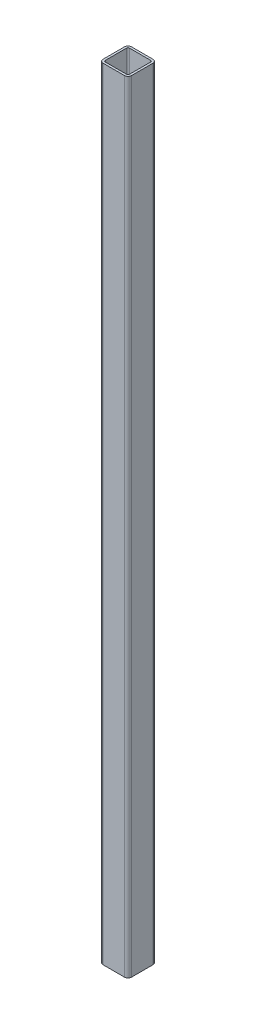
ISO-10303-21;
HEADER;
FILE_DESCRIPTION(('STEP AP214'),'2;1');
FILE_NAME('part.step','',(''),(''),'','','');
FILE_SCHEMA(('AUTOMOTIVE_DESIGN { 1 0 10303 214 1 1 1 1 }'));
ENDSEC;
DATA;
#1=APPLICATION_CONTEXT('core data for automotive mechanical design processes');
#2=APPLICATION_PROTOCOL_DEFINITION('international standard','automotive_design',2000,#1);
#3=PRODUCT_CONTEXT('',#1,'mechanical');
#4=PRODUCT('Part','Part','',(#3));
#5=PRODUCT_RELATED_PRODUCT_CATEGORY('part','',(#4));
#6=PRODUCT_DEFINITION_FORMATION('','',#4);
#7=PRODUCT_DEFINITION_CONTEXT('part definition',#1,'design');
#8=PRODUCT_DEFINITION('design','',#6,#7);
#9=PRODUCT_DEFINITION_SHAPE('','',#8);
#10=(LENGTH_UNIT() NAMED_UNIT(*) SI_UNIT(.MILLI.,.METRE.));
#11=(NAMED_UNIT(*) PLANE_ANGLE_UNIT() SI_UNIT($,.RADIAN.));
#12=(NAMED_UNIT(*) SI_UNIT($,.STERADIAN.) SOLID_ANGLE_UNIT());
#13=UNCERTAINTY_MEASURE_WITH_UNIT(LENGTH_MEASURE(1.E-05),#10,'distance_accuracy_value','');
#14=(GEOMETRIC_REPRESENTATION_CONTEXT(3) GLOBAL_UNCERTAINTY_ASSIGNED_CONTEXT((#13)) GLOBAL_UNIT_ASSIGNED_CONTEXT((#10,
#11,#12)) REPRESENTATION_CONTEXT('',''));
#15=CARTESIAN_POINT('',(0.,0.,0.));
#16=DIRECTION('',(0.,0.,1.));
#17=DIRECTION('',(1.,0.,0.));
#18=AXIS2_PLACEMENT_3D('',#15,#16,#17);
#19=CARTESIAN_POINT('',(-15.,1100.,15.));
#20=DIRECTION('',(0.,1.,0.));
#21=DIRECTION('',(0.,0.,1.));
#22=AXIS2_PLACEMENT_3D('',#19,#20,#21);
#23=PLANE('',#22);
#24=CARTESIAN_POINT('',(-15.,1100.,15.));
#25=DIRECTION('',(0.,1.,0.));
#26=DIRECTION('',(0.,0.,1.));
#27=AXIS2_PLACEMENT_3D('',#24,#25,#26);
#28=CIRCLE('',#27,5.);
#29=CARTESIAN_POINT('',(-20.,1100.,15.));
#30=VERTEX_POINT('',#29);
#31=CARTESIAN_POINT('',(-15.,1100.,20.));
#32=VERTEX_POINT('',#31);
#33=EDGE_CURVE('E261',#30,#32,#28,.T.);
#34=ORIENTED_EDGE('',*,*,#33,.T.);
#35=DIRECTION('',(1.,0.,0.));
#36=VECTOR('',#35,1.);
#37=CARTESIAN_POINT('',(-15.,1100.,20.));
#38=LINE('',#37,#36);
#39=CARTESIAN_POINT('',(15.,1100.,20.));
#40=VERTEX_POINT('',#39);
#41=EDGE_CURVE('E264',#32,#40,#38,.T.);
#42=ORIENTED_EDGE('',*,*,#41,.T.);
#43=CARTESIAN_POINT('',(15.,1100.,15.));
#44=DIRECTION('',(0.,1.,0.));
#45=DIRECTION('',(0.,0.,1.));
#46=AXIS2_PLACEMENT_3D('',#43,#44,#45);
#47=CIRCLE('',#46,5.);
#48=CARTESIAN_POINT('',(20.,1100.,15.));
#49=VERTEX_POINT('',#48);
#50=EDGE_CURVE('E267',#40,#49,#47,.T.);
#51=ORIENTED_EDGE('',*,*,#50,.T.);
#52=DIRECTION('',(0.,0.,-1.));
#53=VECTOR('',#52,1.);
#54=CARTESIAN_POINT('',(20.,1100.,-15.));
#55=LINE('',#54,#53);
#56=CARTESIAN_POINT('',(20.,1100.,-15.));
#57=VERTEX_POINT('',#56);
#58=EDGE_CURVE('E269',#49,#57,#55,.T.);
#59=ORIENTED_EDGE('',*,*,#58,.T.);
#60=CARTESIAN_POINT('',(15.,1100.,-15.));
#61=DIRECTION('',(0.,1.,0.));
#62=DIRECTION('',(0.,0.,-1.));
#63=AXIS2_PLACEMENT_3D('',#60,#61,#62);
#64=CIRCLE('',#63,5.);
#65=CARTESIAN_POINT('',(15.,1100.,-20.));
#66=VERTEX_POINT('',#65);
#67=EDGE_CURVE('E271',#57,#66,#64,.T.);
#68=ORIENTED_EDGE('',*,*,#67,.T.);
#69=DIRECTION('',(-1.,0.,0.));
#70=VECTOR('',#69,1.);
#71=CARTESIAN_POINT('',(-15.,1100.,-20.));
#72=LINE('',#71,#70);
#73=CARTESIAN_POINT('',(-15.,1100.,-20.));
#74=VERTEX_POINT('',#73);
#75=EDGE_CURVE('E273',#66,#74,#72,.T.);
#76=ORIENTED_EDGE('',*,*,#75,.T.);
#77=CARTESIAN_POINT('',(-15.,1100.,-15.));
#78=DIRECTION('',(0.,1.,0.));
#79=DIRECTION('',(0.,0.,1.));
#80=AXIS2_PLACEMENT_3D('',#77,#78,#79);
#81=CIRCLE('',#80,5.);
#82=CARTESIAN_POINT('',(-20.,1100.,-15.));
#83=VERTEX_POINT('',#82);
#84=EDGE_CURVE('E275',#74,#83,#81,.T.);
#85=ORIENTED_EDGE('',*,*,#84,.T.);
#86=DIRECTION('',(0.,0.,1.));
#87=VECTOR('',#86,1.);
#88=CARTESIAN_POINT('',(-20.,1100.,-15.));
#89=LINE('',#88,#87);
#90=EDGE_CURVE('E277',#83,#30,#89,.T.);
#91=ORIENTED_EDGE('',*,*,#90,.T.);
#92=EDGE_LOOP('',(#34,#42,#51,#59,#68,#76,#85,#91));
#93=FACE_BOUND('',#92,.T.);
#94=DIRECTION('',(1.,0.,0.));
#95=VECTOR('',#94,1.);
#96=CARTESIAN_POINT('',(-15.,1100.,17.));
#97=LINE('',#96,#95);
#98=CARTESIAN_POINT('',(-15.,1100.,17.));
#99=VERTEX_POINT('',#98);
#100=CARTESIAN_POINT('',(15.,1100.,17.));
#101=VERTEX_POINT('',#100);
#102=EDGE_CURVE('E204',#99,#101,#97,.T.);
#103=ORIENTED_EDGE('',*,*,#102,.F.);
#104=CARTESIAN_POINT('',(-15.,1100.,15.));
#105=DIRECTION('',(0.,1.,0.));
#106=DIRECTION('',(1.,0.,0.));
#107=AXIS2_PLACEMENT_3D('',#104,#105,#106);
#108=CIRCLE('',#107,2.);
#109=CARTESIAN_POINT('',(-17.,1100.,15.));
#110=VERTEX_POINT('',#109);
#111=EDGE_CURVE('E196',#110,#99,#108,.T.);
#112=ORIENTED_EDGE('',*,*,#111,.F.);
#113=DIRECTION('',(0.,0.,1.));
#114=VECTOR('',#113,1.);
#115=CARTESIAN_POINT('',(-17.,1100.,-15.));
#116=LINE('',#115,#114);
#117=CARTESIAN_POINT('',(-17.,1100.,-15.));
#118=VERTEX_POINT('',#117);
#119=EDGE_CURVE('E229',#118,#110,#116,.T.);
#120=ORIENTED_EDGE('',*,*,#119,.F.);
#121=CARTESIAN_POINT('',(-15.,1100.,-15.));
#122=DIRECTION('',(0.,1.,0.));
#123=DIRECTION('',(1.,0.,0.));
#124=AXIS2_PLACEMENT_3D('',#121,#122,#123);
#125=CIRCLE('',#124,2.);
#126=CARTESIAN_POINT('',(-15.,1100.,-17.));
#127=VERTEX_POINT('',#126);
#128=EDGE_CURVE('E227',#127,#118,#125,.T.);
#129=ORIENTED_EDGE('',*,*,#128,.F.);
#130=DIRECTION('',(-1.,0.,0.));
#131=VECTOR('',#130,1.);
#132=CARTESIAN_POINT('',(-15.,1100.,-17.));
#133=LINE('',#132,#131);
#134=CARTESIAN_POINT('',(15.,1100.,-17.));
#135=VERTEX_POINT('',#134);
#136=EDGE_CURVE('E225',#135,#127,#133,.T.);
#137=ORIENTED_EDGE('',*,*,#136,.F.);
#138=CARTESIAN_POINT('',(15.,1100.,-15.));
#139=DIRECTION('',(0.,1.,0.));
#140=DIRECTION('',(1.,0.,0.));
#141=AXIS2_PLACEMENT_3D('',#138,#139,#140);
#142=CIRCLE('',#141,2.);
#143=CARTESIAN_POINT('',(17.,1100.,-15.));
#144=VERTEX_POINT('',#143);
#145=EDGE_CURVE('E223',#144,#135,#142,.T.);
#146=ORIENTED_EDGE('',*,*,#145,.F.);
#147=DIRECTION('',(0.,0.,-1.));
#148=VECTOR('',#147,1.);
#149=CARTESIAN_POINT('',(17.,1100.,-15.));
#150=LINE('',#149,#148);
#151=CARTESIAN_POINT('',(17.,1100.,15.));
#152=VERTEX_POINT('',#151);
#153=EDGE_CURVE('E219',#152,#144,#150,.T.);
#154=ORIENTED_EDGE('',*,*,#153,.F.);
#155=CARTESIAN_POINT('',(15.,1100.,15.));
#156=DIRECTION('',(0.,1.,0.));
#157=DIRECTION('',(1.,0.,0.));
#158=AXIS2_PLACEMENT_3D('',#155,#156,#157);
#159=CIRCLE('',#158,2.);
#160=EDGE_CURVE('E217',#101,#152,#159,.T.);
#161=ORIENTED_EDGE('',*,*,#160,.F.);
#162=EDGE_LOOP('',(#103,#112,#120,#129,#137,#146,#154,#161));
#163=FACE_BOUND('',#162,.T.);
#164=ADVANCED_FACE('F83',(#93,#163),#23,.T.);
#165=CARTESIAN_POINT('',(-15.,0.,15.));
#166=DIRECTION('',(0.,1.,0.));
#167=DIRECTION('',(0.,0.,1.));
#168=AXIS2_PLACEMENT_3D('',#165,#166,#167);
#169=PLANE('',#168);
#170=CARTESIAN_POINT('',(-15.,0.,15.));
#171=DIRECTION('',(0.,1.,0.));
#172=DIRECTION('',(0.,0.,1.));
#173=AXIS2_PLACEMENT_3D('',#170,#171,#172);
#174=CIRCLE('',#173,5.);
#175=CARTESIAN_POINT('',(-20.,0.,15.));
#176=VERTEX_POINT('',#175);
#177=CARTESIAN_POINT('',(-15.,0.,20.));
#178=VERTEX_POINT('',#177);
#179=EDGE_CURVE('E212',#176,#178,#174,.T.);
#180=ORIENTED_EDGE('',*,*,#179,.F.);
#181=DIRECTION('',(0.,0.,1.));
#182=VECTOR('',#181,1.);
#183=CARTESIAN_POINT('',(-20.,0.,-15.));
#184=LINE('',#183,#182);
#185=CARTESIAN_POINT('',(-20.,0.,-15.));
#186=VERTEX_POINT('',#185);
#187=EDGE_CURVE('E265',#186,#176,#184,.T.);
#188=ORIENTED_EDGE('',*,*,#187,.F.);
#189=CARTESIAN_POINT('',(-15.,0.,-15.));
#190=DIRECTION('',(0.,1.,0.));
#191=DIRECTION('',(0.,0.,1.));
#192=AXIS2_PLACEMENT_3D('',#189,#190,#191);
#193=CIRCLE('',#192,5.);
#194=CARTESIAN_POINT('',(-15.,0.,-20.));
#195=VERTEX_POINT('',#194);
#196=EDGE_CURVE('E292',#195,#186,#193,.T.);
#197=ORIENTED_EDGE('',*,*,#196,.F.);
#198=DIRECTION('',(-1.,0.,0.));
#199=VECTOR('',#198,1.);
#200=CARTESIAN_POINT('',(-15.,0.,-20.));
#201=LINE('',#200,#199);
#202=CARTESIAN_POINT('',(15.,0.,-20.));
#203=VERTEX_POINT('',#202);
#204=EDGE_CURVE('E290',#203,#195,#201,.T.);
#205=ORIENTED_EDGE('',*,*,#204,.F.);
#206=CARTESIAN_POINT('',(15.,0.,-15.));
#207=DIRECTION('',(0.,1.,0.));
#208=DIRECTION('',(0.,0.,-1.));
#209=AXIS2_PLACEMENT_3D('',#206,#207,#208);
#210=CIRCLE('',#209,5.);
#211=CARTESIAN_POINT('',(20.,0.,-15.));
#212=VERTEX_POINT('',#211);
#213=EDGE_CURVE('E288',#212,#203,#210,.T.);
#214=ORIENTED_EDGE('',*,*,#213,.F.);
#215=DIRECTION('',(0.,0.,-1.));
#216=VECTOR('',#215,1.);
#217=CARTESIAN_POINT('',(20.,0.,-15.));
#218=LINE('',#217,#216);
#219=CARTESIAN_POINT('',(20.,0.,15.));
#220=VERTEX_POINT('',#219);
#221=EDGE_CURVE('E286',#220,#212,#218,.T.);
#222=ORIENTED_EDGE('',*,*,#221,.F.);
#223=CARTESIAN_POINT('',(15.,0.,15.));
#224=DIRECTION('',(0.,1.,0.));
#225=DIRECTION('',(0.,0.,1.));
#226=AXIS2_PLACEMENT_3D('',#223,#224,#225);
#227=CIRCLE('',#226,5.);
#228=CARTESIAN_POINT('',(15.,0.,20.));
#229=VERTEX_POINT('',#228);
#230=EDGE_CURVE('E284',#229,#220,#227,.T.);
#231=ORIENTED_EDGE('',*,*,#230,.F.);
#232=DIRECTION('',(1.,0.,0.));
#233=VECTOR('',#232,1.);
#234=CARTESIAN_POINT('',(-15.,0.,20.));
#235=LINE('',#234,#233);
#236=EDGE_CURVE('E282',#178,#229,#235,.T.);
#237=ORIENTED_EDGE('',*,*,#236,.F.);
#238=EDGE_LOOP('',(#180,#188,#197,#205,#214,#222,#231,#237));
#239=FACE_BOUND('',#238,.T.);
#240=CARTESIAN_POINT('',(-15.,0.,15.));
#241=DIRECTION('',(0.,1.,0.));
#242=DIRECTION('',(1.,0.,0.));
#243=AXIS2_PLACEMENT_3D('',#240,#241,#242);
#244=CIRCLE('',#243,2.);
#245=CARTESIAN_POINT('',(-17.,0.,15.));
#246=VERTEX_POINT('',#245);
#247=CARTESIAN_POINT('',(-15.,0.,17.));
#248=VERTEX_POINT('',#247);
#249=EDGE_CURVE('E106',#246,#248,#244,.T.);
#250=ORIENTED_EDGE('',*,*,#249,.T.);
#251=DIRECTION('',(1.,0.,0.));
#252=VECTOR('',#251,1.);
#253=CARTESIAN_POINT('',(-15.,0.,17.));
#254=LINE('',#253,#252);
#255=CARTESIAN_POINT('',(15.,0.,17.));
#256=VERTEX_POINT('',#255);
#257=EDGE_CURVE('E211',#248,#256,#254,.T.);
#258=ORIENTED_EDGE('',*,*,#257,.T.);
#259=CARTESIAN_POINT('',(15.,0.,15.));
#260=DIRECTION('',(0.,1.,0.));
#261=DIRECTION('',(1.,0.,0.));
#262=AXIS2_PLACEMENT_3D('',#259,#260,#261);
#263=CIRCLE('',#262,2.);
#264=CARTESIAN_POINT('',(17.,0.,15.));
#265=VERTEX_POINT('',#264);
#266=EDGE_CURVE('E233',#256,#265,#263,.T.);
#267=ORIENTED_EDGE('',*,*,#266,.T.);
#268=DIRECTION('',(0.,0.,-1.));
#269=VECTOR('',#268,1.);
#270=CARTESIAN_POINT('',(17.,0.,-15.));
#271=LINE('',#270,#269);
#272=CARTESIAN_POINT('',(17.,0.,-15.));
#273=VERTEX_POINT('',#272);
#274=EDGE_CURVE('E236',#265,#273,#271,.T.);
#275=ORIENTED_EDGE('',*,*,#274,.T.);
#276=CARTESIAN_POINT('',(15.,0.,-15.));
#277=DIRECTION('',(0.,1.,0.));
#278=DIRECTION('',(1.,0.,0.));
#279=AXIS2_PLACEMENT_3D('',#276,#277,#278);
#280=CIRCLE('',#279,2.);
#281=CARTESIAN_POINT('',(15.,0.,-17.));
#282=VERTEX_POINT('',#281);
#283=EDGE_CURVE('E239',#273,#282,#280,.T.);
#284=ORIENTED_EDGE('',*,*,#283,.T.);
#285=DIRECTION('',(-1.,0.,0.));
#286=VECTOR('',#285,1.);
#287=CARTESIAN_POINT('',(-15.,0.,-17.));
#288=LINE('',#287,#286);
#289=CARTESIAN_POINT('',(-15.,0.,-17.));
#290=VERTEX_POINT('',#289);
#291=EDGE_CURVE('E242',#282,#290,#288,.T.);
#292=ORIENTED_EDGE('',*,*,#291,.T.);
#293=CARTESIAN_POINT('',(-15.,0.,-15.));
#294=DIRECTION('',(0.,1.,0.));
#295=DIRECTION('',(1.,0.,0.));
#296=AXIS2_PLACEMENT_3D('',#293,#294,#295);
#297=CIRCLE('',#296,2.);
#298=CARTESIAN_POINT('',(-17.,0.,-15.));
#299=VERTEX_POINT('',#298);
#300=EDGE_CURVE('E245',#290,#299,#297,.T.);
#301=ORIENTED_EDGE('',*,*,#300,.T.);
#302=DIRECTION('',(0.,0.,1.));
#303=VECTOR('',#302,1.);
#304=CARTESIAN_POINT('',(-17.,0.,-15.));
#305=LINE('',#304,#303);
#306=EDGE_CURVE('E205',#299,#246,#305,.T.);
#307=ORIENTED_EDGE('',*,*,#306,.T.);
#308=EDGE_LOOP('',(#250,#258,#267,#275,#284,#292,#301,#307));
#309=FACE_BOUND('',#308,.T.);
#310=ADVANCED_FACE('F322',(#239,#309),#169,.F.);
#311=CARTESIAN_POINT('',(-15.,1100.,15.));
#312=DIRECTION('',(0.,-1.,0.));
#313=DIRECTION('',(0.,0.,-1.));
#314=AXIS2_PLACEMENT_3D('',#311,#312,#313);
#315=CYLINDRICAL_SURFACE('',#314,5.);
#316=ORIENTED_EDGE('',*,*,#179,.T.);
#317=DIRECTION('',(0.,-1.,0.));
#318=VECTOR('',#317,1.);
#319=CARTESIAN_POINT('',(-15.,1100.,20.));
#320=LINE('',#319,#318);
#321=EDGE_CURVE('E12',#32,#178,#320,.T.);
#322=ORIENTED_EDGE('',*,*,#321,.F.);
#323=ORIENTED_EDGE('',*,*,#33,.F.);
#324=DIRECTION('',(0.,-1.,0.));
#325=VECTOR('',#324,1.);
#326=CARTESIAN_POINT('',(-20.,1100.,15.));
#327=LINE('',#326,#325);
#328=EDGE_CURVE('E279',#30,#176,#327,.T.);
#329=ORIENTED_EDGE('',*,*,#328,.T.);
#330=EDGE_LOOP('',(#316,#322,#323,#329));
#331=FACE_BOUND('',#330,.T.);
#332=ADVANCED_FACE('F85',(#331),#315,.T.);
#333=CARTESIAN_POINT('',(-15.,1100.,20.));
#334=DIRECTION('',(0.,0.,-1.));
#335=DIRECTION('',(-1.,0.,0.));
#336=AXIS2_PLACEMENT_3D('',#333,#334,#335);
#337=PLANE('',#336);
#338=ORIENTED_EDGE('',*,*,#236,.T.);
#339=DIRECTION('',(0.,-1.,0.));
#340=VECTOR('',#339,1.);
#341=CARTESIAN_POINT('',(15.,1100.,20.));
#342=LINE('',#341,#340);
#343=EDGE_CURVE('E91',#40,#229,#342,.T.);
#344=ORIENTED_EDGE('',*,*,#343,.F.);
#345=ORIENTED_EDGE('',*,*,#41,.F.);
#346=ORIENTED_EDGE('',*,*,#321,.T.);
#347=EDGE_LOOP('',(#338,#344,#345,#346));
#348=FACE_BOUND('',#347,.T.);
#349=ADVANCED_FACE('F339',(#348),#337,.F.);
#350=CARTESIAN_POINT('',(15.,1100.,15.));
#351=DIRECTION('',(0.,-1.,0.));
#352=DIRECTION('',(0.,0.,-1.));
#353=AXIS2_PLACEMENT_3D('',#350,#351,#352);
#354=CYLINDRICAL_SURFACE('',#353,5.);
#355=ORIENTED_EDGE('',*,*,#230,.T.);
#356=DIRECTION('',(0.,-1.,0.));
#357=VECTOR('',#356,1.);
#358=CARTESIAN_POINT('',(20.,1100.,15.));
#359=LINE('',#358,#357);
#360=EDGE_CURVE('E309',#49,#220,#359,.T.);
#361=ORIENTED_EDGE('',*,*,#360,.F.);
#362=ORIENTED_EDGE('',*,*,#50,.F.);
#363=ORIENTED_EDGE('',*,*,#343,.T.);
#364=EDGE_LOOP('',(#355,#361,#362,#363));
#365=FACE_BOUND('',#364,.T.);
#366=ADVANCED_FACE('F316',(#365),#354,.T.);
#367=CARTESIAN_POINT('',(20.,1100.,-15.));
#368=DIRECTION('',(-1.,0.,0.));
#369=DIRECTION('',(0.,0.,1.));
#370=AXIS2_PLACEMENT_3D('',#367,#368,#369);
#371=PLANE('',#370);
#372=ORIENTED_EDGE('',*,*,#221,.T.);
#373=DIRECTION('',(0.,-1.,0.));
#374=VECTOR('',#373,1.);
#375=CARTESIAN_POINT('',(20.,1100.,-15.));
#376=LINE('',#375,#374);
#377=EDGE_CURVE('E306',#57,#212,#376,.T.);
#378=ORIENTED_EDGE('',*,*,#377,.F.);
#379=ORIENTED_EDGE('',*,*,#58,.F.);
#380=ORIENTED_EDGE('',*,*,#360,.T.);
#381=EDGE_LOOP('',(#372,#378,#379,#380));
#382=FACE_BOUND('',#381,.T.);
#383=ADVANCED_FACE('F328',(#382),#371,.F.);
#384=CARTESIAN_POINT('',(15.,1100.,-15.));
#385=DIRECTION('',(0.,-1.,0.));
#386=DIRECTION('',(0.,0.,-1.));
#387=AXIS2_PLACEMENT_3D('',#384,#385,#386);
#388=CYLINDRICAL_SURFACE('',#387,5.);
#389=ORIENTED_EDGE('',*,*,#213,.T.);
#390=DIRECTION('',(0.,-1.,0.));
#391=VECTOR('',#390,1.);
#392=CARTESIAN_POINT('',(15.,1100.,-20.));
#393=LINE('',#392,#391);
#394=EDGE_CURVE('E303',#66,#203,#393,.T.);
#395=ORIENTED_EDGE('',*,*,#394,.F.);
#396=ORIENTED_EDGE('',*,*,#67,.F.);
#397=ORIENTED_EDGE('',*,*,#377,.T.);
#398=EDGE_LOOP('',(#389,#395,#396,#397));
#399=FACE_BOUND('',#398,.T.);
#400=ADVANCED_FACE('F332',(#399),#388,.T.);
#401=CARTESIAN_POINT('',(-15.,1100.,-20.));
#402=DIRECTION('',(0.,0.,1.));
#403=DIRECTION('',(1.,0.,0.));
#404=AXIS2_PLACEMENT_3D('',#401,#402,#403);
#405=PLANE('',#404);
#406=ORIENTED_EDGE('',*,*,#204,.T.);
#407=DIRECTION('',(0.,-1.,0.));
#408=VECTOR('',#407,1.);
#409=CARTESIAN_POINT('',(-15.,1100.,-20.));
#410=LINE('',#409,#408);
#411=EDGE_CURVE('E300',#74,#195,#410,.T.);
#412=ORIENTED_EDGE('',*,*,#411,.F.);
#413=ORIENTED_EDGE('',*,*,#75,.F.);
#414=ORIENTED_EDGE('',*,*,#394,.T.);
#415=EDGE_LOOP('',(#406,#412,#413,#414));
#416=FACE_BOUND('',#415,.T.);
#417=ADVANCED_FACE('F352',(#416),#405,.F.);
#418=CARTESIAN_POINT('',(-15.,1100.,-15.));
#419=DIRECTION('',(0.,-1.,0.));
#420=DIRECTION('',(0.,0.,-1.));
#421=AXIS2_PLACEMENT_3D('',#418,#419,#420);
#422=CYLINDRICAL_SURFACE('',#421,5.);
#423=ORIENTED_EDGE('',*,*,#196,.T.);
#424=DIRECTION('',(0.,-1.,0.));
#425=VECTOR('',#424,1.);
#426=CARTESIAN_POINT('',(-20.,1100.,-15.));
#427=LINE('',#426,#425);
#428=EDGE_CURVE('E297',#83,#186,#427,.T.);
#429=ORIENTED_EDGE('',*,*,#428,.F.);
#430=ORIENTED_EDGE('',*,*,#84,.F.);
#431=ORIENTED_EDGE('',*,*,#411,.T.);
#432=EDGE_LOOP('',(#423,#429,#430,#431));
#433=FACE_BOUND('',#432,.T.);
#434=ADVANCED_FACE('F350',(#433),#422,.T.);
#435=CARTESIAN_POINT('',(-20.,1100.,-15.));
#436=DIRECTION('',(1.,0.,0.));
#437=DIRECTION('',(0.,0.,-1.));
#438=AXIS2_PLACEMENT_3D('',#435,#436,#437);
#439=PLANE('',#438);
#440=ORIENTED_EDGE('',*,*,#187,.T.);
#441=ORIENTED_EDGE('',*,*,#328,.F.);
#442=ORIENTED_EDGE('',*,*,#90,.F.);
#443=ORIENTED_EDGE('',*,*,#428,.T.);
#444=EDGE_LOOP('',(#440,#441,#442,#443));
#445=FACE_BOUND('',#444,.T.);
#446=ADVANCED_FACE('F345',(#445),#439,.F.);
#447=CARTESIAN_POINT('',(-15.,1100.,15.));
#448=DIRECTION('',(0.,-1.,0.));
#449=DIRECTION('',(0.,0.,-1.));
#450=AXIS2_PLACEMENT_3D('',#447,#448,#449);
#451=CYLINDRICAL_SURFACE('',#450,2.);
#452=ORIENTED_EDGE('',*,*,#249,.F.);
#453=DIRECTION('',(0.,-1.,0.));
#454=VECTOR('',#453,1.);
#455=CARTESIAN_POINT('',(-17.,1100.,15.));
#456=LINE('',#455,#454);
#457=EDGE_CURVE('E200',#110,#246,#456,.T.);
#458=ORIENTED_EDGE('',*,*,#457,.F.);
#459=ORIENTED_EDGE('',*,*,#111,.T.);
#460=DIRECTION('',(0.,-1.,0.));
#461=VECTOR('',#460,1.);
#462=CARTESIAN_POINT('',(-15.,1100.,17.));
#463=LINE('',#462,#461);
#464=EDGE_CURVE('E199',#99,#248,#463,.T.);
#465=ORIENTED_EDGE('',*,*,#464,.T.);
#466=EDGE_LOOP('',(#452,#458,#459,#465));
#467=FACE_BOUND('',#466,.T.);
#468=ADVANCED_FACE('F198',(#467),#451,.F.);
#469=CARTESIAN_POINT('',(-15.,1100.,17.));
#470=DIRECTION('',(0.,0.,-1.));
#471=DIRECTION('',(-1.,0.,0.));
#472=AXIS2_PLACEMENT_3D('',#469,#470,#471);
#473=PLANE('',#472);
#474=ORIENTED_EDGE('',*,*,#257,.F.);
#475=ORIENTED_EDGE('',*,*,#464,.F.);
#476=ORIENTED_EDGE('',*,*,#102,.T.);
#477=DIRECTION('',(0.,-1.,0.));
#478=VECTOR('',#477,1.);
#479=CARTESIAN_POINT('',(15.,1100.,17.));
#480=LINE('',#479,#478);
#481=EDGE_CURVE('E213',#101,#256,#480,.T.);
#482=ORIENTED_EDGE('',*,*,#481,.T.);
#483=EDGE_LOOP('',(#474,#475,#476,#482));
#484=FACE_BOUND('',#483,.T.);
#485=ADVANCED_FACE('F208',(#484),#473,.T.);
#486=CARTESIAN_POINT('',(15.,1100.,15.));
#487=DIRECTION('',(0.,-1.,0.));
#488=DIRECTION('',(0.,0.,-1.));
#489=AXIS2_PLACEMENT_3D('',#486,#487,#488);
#490=CYLINDRICAL_SURFACE('',#489,2.);
#491=ORIENTED_EDGE('',*,*,#266,.F.);
#492=ORIENTED_EDGE('',*,*,#481,.F.);
#493=ORIENTED_EDGE('',*,*,#160,.T.);
#494=DIRECTION('',(0.,-1.,0.));
#495=VECTOR('',#494,1.);
#496=CARTESIAN_POINT('',(17.,1100.,15.));
#497=LINE('',#496,#495);
#498=EDGE_CURVE('E258',#152,#265,#497,.T.);
#499=ORIENTED_EDGE('',*,*,#498,.T.);
#500=EDGE_LOOP('',(#491,#492,#493,#499));
#501=FACE_BOUND('',#500,.T.);
#502=ADVANCED_FACE('F377',(#501),#490,.F.);
#503=CARTESIAN_POINT('',(17.,1100.,-15.));
#504=DIRECTION('',(-1.,0.,0.));
#505=DIRECTION('',(0.,0.,1.));
#506=AXIS2_PLACEMENT_3D('',#503,#504,#505);
#507=PLANE('',#506);
#508=ORIENTED_EDGE('',*,*,#274,.F.);
#509=ORIENTED_EDGE('',*,*,#498,.F.);
#510=ORIENTED_EDGE('',*,*,#153,.T.);
#511=DIRECTION('',(0.,-1.,0.));
#512=VECTOR('',#511,1.);
#513=CARTESIAN_POINT('',(17.,1100.,-15.));
#514=LINE('',#513,#512);
#515=EDGE_CURVE('E256',#144,#273,#514,.T.);
#516=ORIENTED_EDGE('',*,*,#515,.T.);
#517=EDGE_LOOP('',(#508,#509,#510,#516));
#518=FACE_BOUND('',#517,.T.);
#519=ADVANCED_FACE('F381',(#518),#507,.T.);
#520=CARTESIAN_POINT('',(15.,1100.,-15.));
#521=DIRECTION('',(0.,-1.,0.));
#522=DIRECTION('',(0.,0.,-1.));
#523=AXIS2_PLACEMENT_3D('',#520,#521,#522);
#524=CYLINDRICAL_SURFACE('',#523,2.);
#525=ORIENTED_EDGE('',*,*,#283,.F.);
#526=ORIENTED_EDGE('',*,*,#515,.F.);
#527=ORIENTED_EDGE('',*,*,#145,.T.);
#528=DIRECTION('',(0.,-1.,0.));
#529=VECTOR('',#528,1.);
#530=CARTESIAN_POINT('',(15.,1100.,-17.));
#531=LINE('',#530,#529);
#532=EDGE_CURVE('E254',#135,#282,#531,.T.);
#533=ORIENTED_EDGE('',*,*,#532,.T.);
#534=EDGE_LOOP('',(#525,#526,#527,#533));
#535=FACE_BOUND('',#534,.T.);
#536=ADVANCED_FACE('F387',(#535),#524,.F.);
#537=CARTESIAN_POINT('',(-15.,1100.,-17.));
#538=DIRECTION('',(0.,0.,1.));
#539=DIRECTION('',(1.,0.,0.));
#540=AXIS2_PLACEMENT_3D('',#537,#538,#539);
#541=PLANE('',#540);
#542=ORIENTED_EDGE('',*,*,#291,.F.);
#543=ORIENTED_EDGE('',*,*,#532,.F.);
#544=ORIENTED_EDGE('',*,*,#136,.T.);
#545=DIRECTION('',(0.,-1.,0.));
#546=VECTOR('',#545,1.);
#547=CARTESIAN_POINT('',(-15.,1100.,-17.));
#548=LINE('',#547,#546);
#549=EDGE_CURVE('E252',#127,#290,#548,.T.);
#550=ORIENTED_EDGE('',*,*,#549,.T.);
#551=EDGE_LOOP('',(#542,#543,#544,#550));
#552=FACE_BOUND('',#551,.T.);
#553=ADVANCED_FACE('F391',(#552),#541,.T.);
#554=CARTESIAN_POINT('',(-15.,1100.,-15.));
#555=DIRECTION('',(0.,-1.,0.));
#556=DIRECTION('',(0.,0.,-1.));
#557=AXIS2_PLACEMENT_3D('',#554,#555,#556);
#558=CYLINDRICAL_SURFACE('',#557,2.);
#559=ORIENTED_EDGE('',*,*,#300,.F.);
#560=ORIENTED_EDGE('',*,*,#549,.F.);
#561=ORIENTED_EDGE('',*,*,#128,.T.);
#562=DIRECTION('',(0.,-1.,0.));
#563=VECTOR('',#562,1.);
#564=CARTESIAN_POINT('',(-17.,1100.,-15.));
#565=LINE('',#564,#563);
#566=EDGE_CURVE('E98',#118,#299,#565,.T.);
#567=ORIENTED_EDGE('',*,*,#566,.T.);
#568=EDGE_LOOP('',(#559,#560,#561,#567));
#569=FACE_BOUND('',#568,.T.);
#570=ADVANCED_FACE('F395',(#569),#558,.F.);
#571=CARTESIAN_POINT('',(-17.,1100.,-15.));
#572=DIRECTION('',(1.,0.,0.));
#573=DIRECTION('',(0.,0.,-1.));
#574=AXIS2_PLACEMENT_3D('',#571,#572,#573);
#575=PLANE('',#574);
#576=ORIENTED_EDGE('',*,*,#306,.F.);
#577=ORIENTED_EDGE('',*,*,#566,.F.);
#578=ORIENTED_EDGE('',*,*,#119,.T.);
#579=ORIENTED_EDGE('',*,*,#457,.T.);
#580=EDGE_LOOP('',(#576,#577,#578,#579));
#581=FACE_BOUND('',#580,.T.);
#582=ADVANCED_FACE('F399',(#581),#575,.T.);
#583=CLOSED_SHELL('',(#164,#310,#332,#349,#366,#383,#400,#417,#434,#446,#468,#485,#502,#519,
#536,#553,#570,#582));
#584=MANIFOLD_SOLID_BREP('B2',#583);
#585=ADVANCED_BREP_SHAPE_REPRESENTATION('',(#18,#584),#14);
#586=SHAPE_DEFINITION_REPRESENTATION(#9,#585);
ENDSEC;
END-ISO-10303-21;
